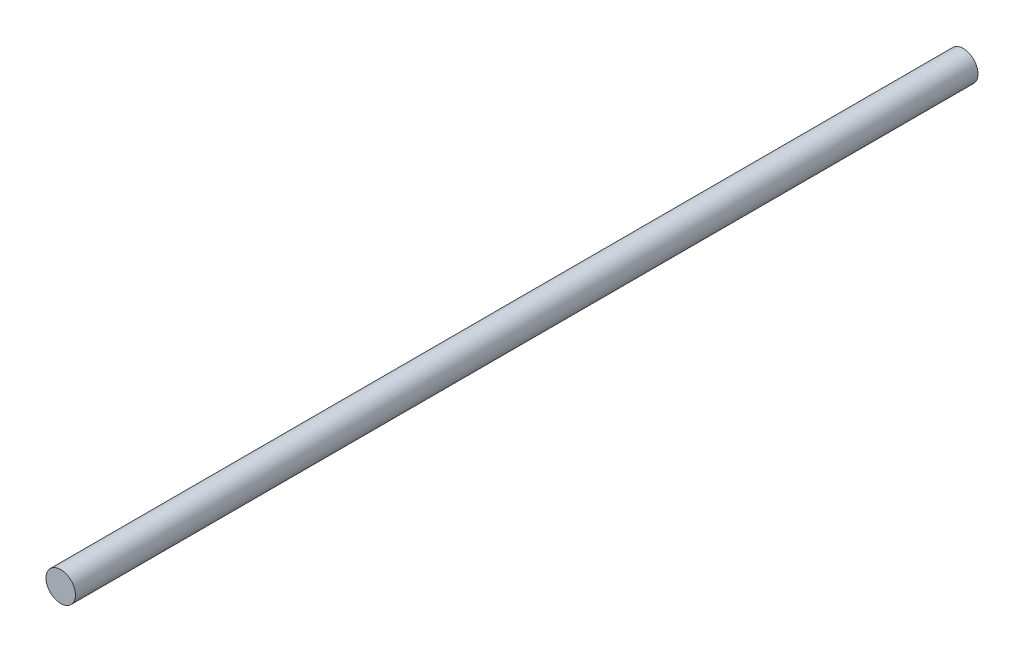
ISO-10303-21;
HEADER;
FILE_DESCRIPTION(('STEP AP214'),'2;1');
FILE_NAME('part.step','',(''),(''),'','','');
FILE_SCHEMA(('AUTOMOTIVE_DESIGN { 1 0 10303 214 1 1 1 1 }'));
ENDSEC;
DATA;
#1=APPLICATION_CONTEXT('core data for automotive mechanical design processes');
#2=APPLICATION_PROTOCOL_DEFINITION('international standard','automotive_design',2000,#1);
#3=PRODUCT_CONTEXT('',#1,'mechanical');
#4=PRODUCT('Part','Part','',(#3));
#5=PRODUCT_RELATED_PRODUCT_CATEGORY('part','',(#4));
#6=PRODUCT_DEFINITION_FORMATION('','',#4);
#7=PRODUCT_DEFINITION_CONTEXT('part definition',#1,'design');
#8=PRODUCT_DEFINITION('design','',#6,#7);
#9=PRODUCT_DEFINITION_SHAPE('','',#8);
#10=(LENGTH_UNIT() NAMED_UNIT(*) SI_UNIT(.MILLI.,.METRE.));
#11=(NAMED_UNIT(*) PLANE_ANGLE_UNIT() SI_UNIT($,.RADIAN.));
#12=(NAMED_UNIT(*) SI_UNIT($,.STERADIAN.) SOLID_ANGLE_UNIT());
#13=UNCERTAINTY_MEASURE_WITH_UNIT(LENGTH_MEASURE(1.E-05),#10,'distance_accuracy_value','');
#14=(GEOMETRIC_REPRESENTATION_CONTEXT(3) GLOBAL_UNCERTAINTY_ASSIGNED_CONTEXT((#13)) GLOBAL_UNIT_ASSIGNED_CONTEXT((#10,
#11,#12)) REPRESENTATION_CONTEXT('',''));
#15=CARTESIAN_POINT('',(0.,0.,0.));
#16=DIRECTION('',(0.,0.,1.));
#17=DIRECTION('',(1.,0.,0.));
#18=AXIS2_PLACEMENT_3D('',#15,#16,#17);
#19=CARTESIAN_POINT('',(0.,0.,241.3));
#20=DIRECTION('',(0.,0.,-1.));
#21=DIRECTION('',(-1.,0.,0.));
#22=AXIS2_PLACEMENT_3D('',#19,#20,#21);
#23=CYLINDRICAL_SURFACE('',#22,3.937);
#24=CARTESIAN_POINT('',(0.,0.,241.3));
#25=DIRECTION('',(0.,0.,1.));
#26=DIRECTION('',(1.,0.,0.));
#27=AXIS2_PLACEMENT_3D('',#24,#25,#26);
#28=CIRCLE('',#27,3.937);
#29=CARTESIAN_POINT('',(3.937,0.,241.3));
#30=VERTEX_POINT('',#29);
#31=EDGE_CURVE('E10',#30,#30,#28,.T.);
#32=ORIENTED_EDGE('',*,*,#31,.F.);
#33=EDGE_LOOP('',(#32));
#34=FACE_BOUND('',#33,.T.);
#35=CARTESIAN_POINT('',(0.,0.,0.));
#36=DIRECTION('',(0.,0.,1.));
#37=DIRECTION('',(1.,0.,0.));
#38=AXIS2_PLACEMENT_3D('',#35,#36,#37);
#39=CIRCLE('',#38,3.937);
#40=CARTESIAN_POINT('',(3.937,0.,0.));
#41=VERTEX_POINT('',#40);
#42=EDGE_CURVE('E36',#41,#41,#39,.T.);
#43=ORIENTED_EDGE('',*,*,#42,.T.);
#44=EDGE_LOOP('',(#43));
#45=FACE_BOUND('',#44,.T.);
#46=ADVANCED_FACE('F33',(#34,#45),#23,.T.);
#47=CARTESIAN_POINT('',(0.,0.,241.3));
#48=DIRECTION('',(0.,0.,1.));
#49=DIRECTION('',(1.,0.,0.));
#50=AXIS2_PLACEMENT_3D('',#47,#48,#49);
#51=PLANE('',#50);
#52=ORIENTED_EDGE('',*,*,#31,.T.);
#53=EDGE_LOOP('',(#52));
#54=FACE_BOUND('',#53,.T.);
#55=ADVANCED_FACE('F48',(#54),#51,.T.);
#56=CARTESIAN_POINT('',(0.,0.,0.));
#57=DIRECTION('',(0.,0.,1.));
#58=DIRECTION('',(1.,0.,0.));
#59=AXIS2_PLACEMENT_3D('',#56,#57,#58);
#60=PLANE('',#59);
#61=ORIENTED_EDGE('',*,*,#42,.F.);
#62=EDGE_LOOP('',(#61));
#63=FACE_BOUND('',#62,.T.);
#64=ADVANCED_FACE('F46',(#63),#60,.F.);
#65=CLOSED_SHELL('',(#46,#55,#64));
#66=MANIFOLD_SOLID_BREP('B2',#65);
#67=ADVANCED_BREP_SHAPE_REPRESENTATION('',(#18,#66),#14);
#68=SHAPE_DEFINITION_REPRESENTATION(#9,#67);
ENDSEC;
END-ISO-10303-21;
